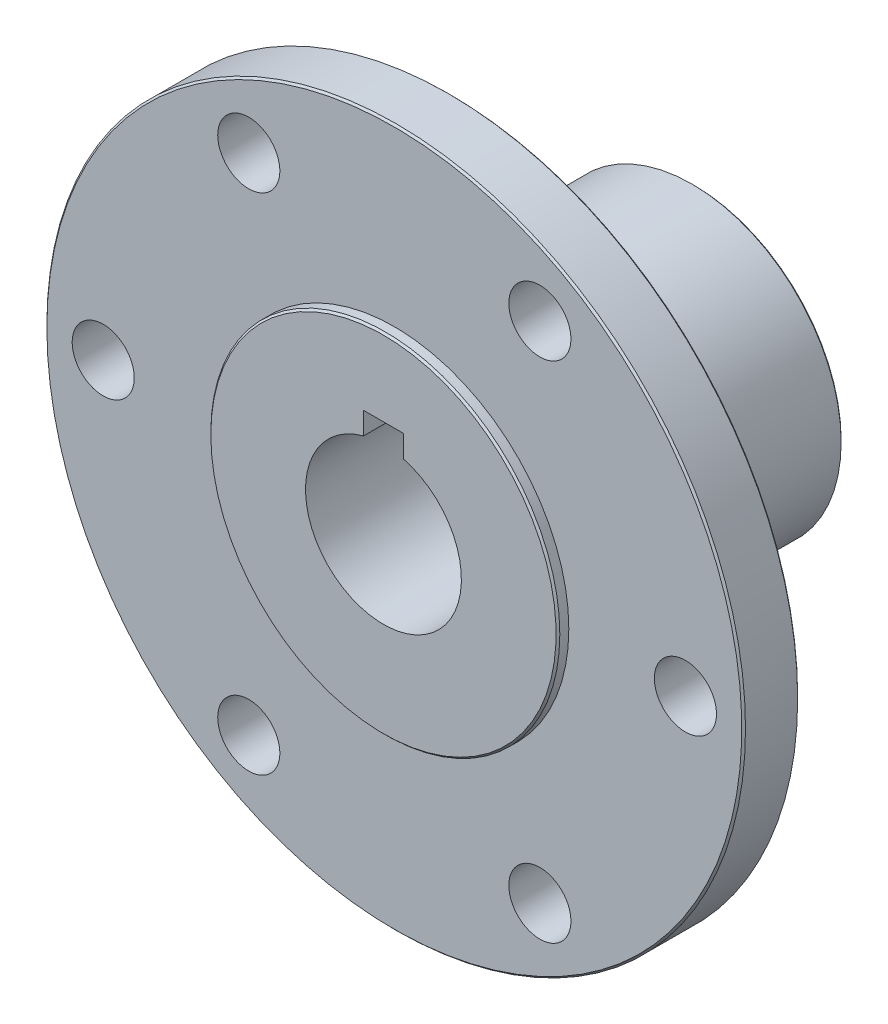
ISO-10303-21;
HEADER;
FILE_DESCRIPTION(('STEP AP214'),'2;1');
FILE_NAME('part.step','',(''),(''),'','','');
FILE_SCHEMA(('AUTOMOTIVE_DESIGN { 1 0 10303 214 1 1 1 1 }'));
ENDSEC;
DATA;
#1=APPLICATION_CONTEXT('core data for automotive mechanical design processes');
#2=APPLICATION_PROTOCOL_DEFINITION('international standard','automotive_design',2000,#1);
#3=PRODUCT_CONTEXT('',#1,'mechanical');
#4=PRODUCT('Part','Part','',(#3));
#5=PRODUCT_RELATED_PRODUCT_CATEGORY('part','',(#4));
#6=PRODUCT_DEFINITION_FORMATION('','',#4);
#7=PRODUCT_DEFINITION_CONTEXT('part definition',#1,'design');
#8=PRODUCT_DEFINITION('design','',#6,#7);
#9=PRODUCT_DEFINITION_SHAPE('','',#8);
#10=(LENGTH_UNIT() NAMED_UNIT(*) SI_UNIT(.MILLI.,.METRE.));
#11=(NAMED_UNIT(*) PLANE_ANGLE_UNIT() SI_UNIT($,.RADIAN.));
#12=(NAMED_UNIT(*) SI_UNIT($,.STERADIAN.) SOLID_ANGLE_UNIT());
#13=UNCERTAINTY_MEASURE_WITH_UNIT(LENGTH_MEASURE(1.E-05),#10,'distance_accuracy_value','');
#14=(GEOMETRIC_REPRESENTATION_CONTEXT(3) GLOBAL_UNCERTAINTY_ASSIGNED_CONTEXT((#13)) GLOBAL_UNIT_ASSIGNED_CONTEXT((#10,
#11,#12)) REPRESENTATION_CONTEXT('',''));
#15=CARTESIAN_POINT('',(0.,0.,0.));
#16=DIRECTION('',(0.,0.,1.));
#17=DIRECTION('',(1.,0.,0.));
#18=AXIS2_PLACEMENT_3D('',#15,#16,#17);
#19=CARTESIAN_POINT('',(0.,0.,-19.05));
#20=DIRECTION('',(0.,0.,1.));
#21=DIRECTION('',(1.,0.,0.));
#22=AXIS2_PLACEMENT_3D('',#19,#20,#21);
#23=CYLINDRICAL_SURFACE('',#22,12.192);
#24=CARTESIAN_POINT('',(0.,-12.192,-6.35));
#25=CARTESIAN_POINT('',(-0.175178769078229,-12.1919972222022,-6.35000445992635));
#26=CARTESIAN_POINT('',(-0.350406075703609,-12.1881871263774,-6.36454675198558));
#27=CARTESIAN_POINT('',(-0.69582271597809,-12.1733575982962,-6.42223479864495));
#28=CARTESIAN_POINT('',(-0.866009414013592,-12.1623344617222,-6.4653952504933));
#29=CARTESIAN_POINT('',(-1.19630816090729,-12.1342970377197,-6.57882867425515));
#30=CARTESIAN_POINT('',(-1.35643256848508,-12.1172902759936,-6.64906759970726));
#31=CARTESIAN_POINT('',(-1.66262756367885,-12.0790882117793,-6.81454036967587));
#32=CARTESIAN_POINT('',(-1.80869738842925,-12.0578926821203,-6.90977556991492));
#33=CARTESIAN_POINT('',(-2.08587969639434,-12.0130801685357,-7.12477018626725));
#34=CARTESIAN_POINT('',(-2.21663569350621,-11.9894233161875,-7.24498090776616));
#35=CARTESIAN_POINT('',(-2.45637791012349,-11.9426137863003,-7.50554890841107));
#36=CARTESIAN_POINT('',(-2.56536146238018,-11.9194611708422,-7.64590865231206));
#37=CARTESIAN_POINT('',(-2.76017972152825,-11.8758759937563,-7.94560625643621));
#38=CARTESIAN_POINT('',(-2.84560865341558,-11.855493854447,-8.1052158942289));
#39=CARTESIAN_POINT('',(-2.98828064189423,-11.820341753401,-8.43714862683517));
#40=CARTESIAN_POINT('',(-3.04552862936049,-11.8055708099658,-8.60946949146899));
#41=CARTESIAN_POINT('',(-3.12898396973005,-11.7837244369758,-8.9579956662678));
#42=CARTESIAN_POINT('',(-3.1558356271565,-11.7764895433296,-9.13403646158879));
#43=CARTESIAN_POINT('',(-3.17974412565684,-11.7700576598422,-9.48826130575506));
#44=CARTESIAN_POINT('',(-3.17680625627158,-11.7708592430136,-9.66644496849264));
#45=CARTESIAN_POINT('',(-3.1417315809834,-11.7802667818599,-10.0149036188275));
#46=CARTESIAN_POINT('',(-3.11036983081411,-11.7886655670421,-10.1852630974607));
#47=CARTESIAN_POINT('',(-3.02057709146969,-11.8119900572499,-10.5182150055736));
#48=CARTESIAN_POINT('',(-2.96214402837624,-11.8269162623325,-10.6808068389254));
#49=CARTESIAN_POINT('',(-2.81922481050141,-11.8617989909066,-10.995650457932));
#50=CARTESIAN_POINT('',(-2.73446329751622,-11.8818082528489,-11.1477711589043));
#51=CARTESIAN_POINT('',(-2.54148552382977,-11.9245736653226,-11.4359045532966));
#52=CARTESIAN_POINT('',(-2.43326484044204,-11.9473303334554,-11.5719142018612));
#53=CARTESIAN_POINT('',(-2.19245799922452,-11.9938926137752,-11.8283980558035));
#54=CARTESIAN_POINT('',(-2.05921975178593,-12.0177088584428,-11.9482589249626));
#55=CARTESIAN_POINT('',(-1.77424487472883,-12.0630719627827,-12.1640576353961));
#56=CARTESIAN_POINT('',(-1.62250758164116,-12.0846187410086,-12.259994618263));
#57=CARTESIAN_POINT('',(-1.30392064852997,-12.1231377422072,-12.4254750383825));
#58=CARTESIAN_POINT('',(-1.13701322593496,-12.1400914038242,-12.4949118334487));
#59=CARTESIAN_POINT('',(-0.793352902722708,-12.167379518368,-12.6045663767765));
#60=CARTESIAN_POINT('',(-0.616602058951869,-12.1777153485344,-12.6447902047945));
#61=CARTESIAN_POINT('',(-0.263510176518137,-12.1903966573512,-12.6939240637056));
#62=CARTESIAN_POINT('',(-0.0872927168625877,-12.1929549929709,-12.7036684857243));
#63=CARTESIAN_POINT('',(0.26425711890912,-12.1904028480231,-12.6938651771711));
#64=CARTESIAN_POINT('',(0.439589580267204,-12.1852931207434,-12.674320323891));
#65=CARTESIAN_POINT('',(0.781444332473162,-12.1681160682014,-12.6071790148851));
#66=CARTESIAN_POINT('',(0.948063544289819,-12.1561632779101,-12.5600440609912));
#67=CARTESIAN_POINT('',(1.27101681880787,-12.126652422739,-12.4395930997122));
#68=CARTESIAN_POINT('',(1.42734979229547,-12.1090937654003,-12.3662743249788));
#69=CARTESIAN_POINT('',(1.72856473093804,-12.0698158147332,-12.1939628893027));
#70=CARTESIAN_POINT('',(1.87317442579228,-12.0480241570007,-12.094511178757));
#71=CARTESIAN_POINT('',(2.14394674751112,-12.0028010574438,-11.8733376886977));
#72=CARTESIAN_POINT('',(2.27010589802543,-11.9793693078288,-11.7516117220924));
#73=CARTESIAN_POINT('',(2.50388259717037,-11.9327301664181,-11.4854583024661));
#74=CARTESIAN_POINT('',(2.61091266989061,-11.909545614015,-11.3405099110365));
#75=CARTESIAN_POINT('',(2.79913754857967,-11.8667201282515,-11.0342241586555));
#76=CARTESIAN_POINT('',(2.88033346670689,-11.8470790423609,-10.8728875036123));
#77=CARTESIAN_POINT('',(3.01397438194957,-11.8137871881037,-10.5392378596927));
#78=CARTESIAN_POINT('',(3.06658807255543,-11.8001013690893,-10.3669961238854));
#79=CARTESIAN_POINT('',(3.14198917782765,-11.7802511412504,-10.0156960889298));
#80=CARTESIAN_POINT('',(3.16478378791037,-11.7740849179536,-9.83663944497126));
#81=CARTESIAN_POINT('',(3.17950004547031,-11.7701185981767,-9.48279272452331));
#82=CARTESIAN_POINT('',(3.17236384809854,-11.7720631807374,-9.30804409210789));
#83=CARTESIAN_POINT('',(3.12959538170951,-11.783504438539,-8.96233429077626));
#84=CARTESIAN_POINT('',(3.09396378269,-11.7930009362158,-8.79137303290658));
#85=CARTESIAN_POINT('',(2.99575033519074,-11.818327668863,-8.45921503225583));
#86=CARTESIAN_POINT('',(2.93335937690623,-11.8341129863162,-8.29795818277496));
#87=CARTESIAN_POINT('',(2.78354734008,-11.8702417530349,-7.98808132680459));
#88=CARTESIAN_POINT('',(2.69612250463512,-11.8905858863549,-7.83946322139149));
#89=CARTESIAN_POINT('',(2.49583153114034,-11.9342556818932,-7.55456404632131));
#90=CARTESIAN_POINT('',(2.38231830892747,-11.9576491699038,-7.41874822317543));
#91=CARTESIAN_POINT('',(2.13431504479822,-12.0043932959216,-7.16778640214905));
#92=CARTESIAN_POINT('',(1.99981995839061,-12.0277439222544,-7.05264538929406));
#93=CARTESIAN_POINT('',(1.71040597613153,-12.0723325696543,-6.84403179664104));
#94=CARTESIAN_POINT('',(1.55513068393735,-12.093518649746,-6.75104164726823));
#95=CARTESIAN_POINT('',(1.23060806509617,-12.1308309959165,-6.59263206744137));
#96=CARTESIAN_POINT('',(1.06137019914677,-12.1469606531093,-6.52719414880437));
#97=CARTESIAN_POINT('',(0.743860160391215,-12.1701420697107,-6.43473476550779));
#98=CARTESIAN_POINT('',(0.597013452551387,-12.1782803860783,-6.40303104462439));
#99=CARTESIAN_POINT('',(0.300122847168798,-12.1892103025645,-6.36066269012588));
#100=CARTESIAN_POINT('',(0.150079236134964,-12.1920023797962,-6.34999617908983));
#101=CARTESIAN_POINT('',(0.,-12.192,-6.35));
#102=B_SPLINE_CURVE_WITH_KNOTS('',3,(#24,#25,#26,#27,#28,#29,#30,#31,#32,#33,#34,#35,#36,#37,
#38,#39,#40,#41,#42,#43,#44,#45,#46,#47,#48,#49,#50,#51,#52,#53,#54,#55,#56,#57,#58,#59,#60,#61,
#62,#63,#64,#65,#66,#67,#68,#69,#70,#71,#72,#73,#74,#75,#76,#77,#78,#79,#80,#81,#82,#83,#84,#85,
#86,#87,#88,#89,#90,#91,#92,#93,#94,#95,#96,#97,#98,#99,#100,#101),.UNSPECIFIED.,.T.,.F.,(4,2,2,
2,2,2,2,2,2,2,2,2,2,2,2,2,2,2,2,2,2,2,2,2,2,2,2,2,2,2,2,2,2,2,2,2,2,2,4),(0.,0.524986079765197,
1.05024198236789,1.5748396098191,2.0994656957448,2.63455683489542,3.16971348562067,
3.71358302734362,4.25735737329486,4.7893759820574,5.32130012524169,5.83914239830304,
6.35702434953643,6.8805161484106,7.40410672557756,7.94395115407615,8.48381494982038,
9.02582891814377,9.5677300510266,10.0946603470404,10.621538882372,11.1398464173776,
11.6582087481364,12.1863682028415,12.7146270426001,13.2570421426754,13.7994338886615,
14.3385886416688,14.8776132713153,15.3998000543289,15.9219745597935,16.4404844749107,
16.9590722450633,17.4922630352716,18.0255822141286,18.5696287497086,19.1133096334333,
19.5631160945414,20.012882411814),.UNSPECIFIED.);
#103=CARTESIAN_POINT('',(0.,-12.192,-6.35));
#104=VERTEX_POINT('',#103);
#105=EDGE_CURVE('E118',#104,#104,#102,.T.);
#106=ORIENTED_EDGE('',*,*,#105,.F.);
#107=EDGE_LOOP('',(#106));
#108=FACE_BOUND('',#107,.T.);
#109=CARTESIAN_POINT('',(0.,0.,-0.50800000000005));
#110=DIRECTION('',(0.,0.,1.));
#111=DIRECTION('',(1.,0.,0.));
#112=AXIS2_PLACEMENT_3D('',#109,#110,#111);
#113=CIRCLE('',#112,12.192);
#114=CARTESIAN_POINT('',(12.192,0.,-0.50800000000005));
#115=VERTEX_POINT('',#114);
#116=EDGE_CURVE('E112',#115,#115,#113,.T.);
#117=ORIENTED_EDGE('',*,*,#116,.F.);
#118=EDGE_LOOP('',(#117));
#119=FACE_BOUND('',#118,.T.);
#120=CARTESIAN_POINT('',(0.,0.,-18.8976000000001));
#121=DIRECTION('',(0.,0.,1.));
#122=DIRECTION('',(1.,0.,0.));
#123=AXIS2_PLACEMENT_3D('',#120,#121,#122);
#124=CIRCLE('',#123,12.192);
#125=CARTESIAN_POINT('',(12.192,0.,-18.8976000000001));
#126=VERTEX_POINT('',#125);
#127=EDGE_CURVE('E116',#126,#126,#124,.F.);
#128=ORIENTED_EDGE('',*,*,#127,.F.);
#129=EDGE_LOOP('',(#128));
#130=FACE_BOUND('',#129,.T.);
#131=ADVANCED_FACE('F34',(#108,#119,#130),#23,.T.);
#132=CARTESIAN_POINT('',(0.,0.,-18.8976000000001));
#133=DIRECTION('',(0.,0.,1.));
#134=DIRECTION('',(1.,0.,0.));
#135=AXIS2_PLACEMENT_3D('',#132,#133,#134);
#136=CONICAL_SURFACE('',#135,12.192,0.785398163397448);
#137=ORIENTED_EDGE('',*,*,#127,.T.);
#138=EDGE_LOOP('',(#137));
#139=FACE_BOUND('',#138,.T.);
#140=CARTESIAN_POINT('',(0.,0.,-19.05));
#141=DIRECTION('',(0.,0.,1.));
#142=DIRECTION('',(1.,0.,0.));
#143=AXIS2_PLACEMENT_3D('',#140,#141,#142);
#144=CIRCLE('',#143,12.0396000000001);
#145=CARTESIAN_POINT('',(12.0396000000001,0.,-19.05));
#146=VERTEX_POINT('',#145);
#147=EDGE_CURVE('E115',#146,#146,#144,.F.);
#148=ORIENTED_EDGE('',*,*,#147,.F.);
#149=EDGE_LOOP('',(#148));
#150=FACE_BOUND('',#149,.T.);
#151=ADVANCED_FACE('F179',(#139,#150),#136,.T.);
#152=CARTESIAN_POINT('',(0.,0.,0.));
#153=DIRECTION('',(0.,0.,1.));
#154=DIRECTION('',(1.,0.,0.));
#155=AXIS2_PLACEMENT_3D('',#152,#153,#154);
#156=CONICAL_SURFACE('',#155,12.7,0.785398163397448);
#157=CARTESIAN_POINT('',(0.,0.,0.));
#158=DIRECTION('',(0.,0.,1.));
#159=DIRECTION('',(1.,0.,0.));
#160=AXIS2_PLACEMENT_3D('',#157,#158,#159);
#161=CIRCLE('',#160,12.7);
#162=CARTESIAN_POINT('',(12.7,0.,0.));
#163=VERTEX_POINT('',#162);
#164=EDGE_CURVE('E98',#163,#163,#161,.F.);
#165=ORIENTED_EDGE('',*,*,#164,.T.);
#166=EDGE_LOOP('',(#165));
#167=FACE_BOUND('',#166,.T.);
#168=ORIENTED_EDGE('',*,*,#116,.T.);
#169=EDGE_LOOP('',(#168));
#170=FACE_BOUND('',#169,.T.);
#171=ADVANCED_FACE('F181',(#167,#170),#156,.T.);
#172=CARTESIAN_POINT('',(0.,0.,-19.05));
#173=DIRECTION('',(0.,0.,-1.));
#174=DIRECTION('',(-1.,0.,0.));
#175=AXIS2_PLACEMENT_3D('',#172,#173,#174);
#176=PLANE('',#175);
#177=DIRECTION('',(1.,0.,0.));
#178=VECTOR('',#177,1.);
#179=CARTESIAN_POINT('',(-1.6256,7.9756,-19.05));
#180=LINE('',#179,#178);
#181=CARTESIAN_POINT('',(-1.6256,7.9756,-19.05));
#182=VERTEX_POINT('',#181);
#183=CARTESIAN_POINT('',(1.6256,7.9756,-19.05));
#184=VERTEX_POINT('',#183);
#185=EDGE_CURVE('E108',#182,#184,#180,.T.);
#186=ORIENTED_EDGE('',*,*,#185,.F.);
#187=DIRECTION('',(0.,1.,0.));
#188=VECTOR('',#187,1.);
#189=CARTESIAN_POINT('',(-1.6256,6.16466948019113,-19.05));
#190=LINE('',#189,#188);
#191=CARTESIAN_POINT('',(-1.6256,6.16466948019113,-19.05));
#192=VERTEX_POINT('',#191);
#193=EDGE_CURVE('E85',#192,#182,#190,.T.);
#194=ORIENTED_EDGE('',*,*,#193,.F.);
#195=CARTESIAN_POINT('',(0.,0.,-19.05));
#196=DIRECTION('',(0.,0.,-1.));
#197=DIRECTION('',(-1.,0.,0.));
#198=AXIS2_PLACEMENT_3D('',#195,#196,#197);
#199=CIRCLE('',#198,6.3754);
#200=CARTESIAN_POINT('',(1.6256,6.16466948019113,-19.05));
#201=VERTEX_POINT('',#200);
#202=EDGE_CURVE('E76',#192,#201,#199,.F.);
#203=ORIENTED_EDGE('',*,*,#202,.T.);
#204=DIRECTION('',(0.,-1.,0.));
#205=VECTOR('',#204,1.);
#206=CARTESIAN_POINT('',(1.6256,7.9756,-19.05));
#207=LINE('',#206,#205);
#208=EDGE_CURVE('E83',#184,#201,#207,.T.);
#209=ORIENTED_EDGE('',*,*,#208,.F.);
#210=EDGE_LOOP('',(#186,#194,#203,#209));
#211=FACE_BOUND('',#210,.T.);
#212=ORIENTED_EDGE('',*,*,#147,.T.);
#213=EDGE_LOOP('',(#212));
#214=FACE_BOUND('',#213,.T.);
#215=ADVANCED_FACE('F81',(#211,#214),#176,.T.);
#216=CARTESIAN_POINT('',(0.,0.,0.));
#217=DIRECTION('',(0.,0.,1.));
#218=DIRECTION('',(1.,0.,0.));
#219=AXIS2_PLACEMENT_3D('',#216,#217,#218);
#220=PLANE('',#219);
#221=ORIENTED_EDGE('',*,*,#164,.F.);
#222=EDGE_LOOP('',(#221));
#223=FACE_BOUND('',#222,.T.);
#224=CARTESIAN_POINT('',(0.,0.,0.));
#225=DIRECTION('',(0.,0.,1.));
#226=DIRECTION('',(1.,0.,0.));
#227=AXIS2_PLACEMENT_3D('',#224,#225,#226);
#228=CIRCLE('',#227,14.1224);
#229=CARTESIAN_POINT('',(14.1224,0.,0.));
#230=VERTEX_POINT('',#229);
#231=EDGE_CURVE('E107',#230,#230,#228,.T.);
#232=ORIENTED_EDGE('',*,*,#231,.F.);
#233=EDGE_LOOP('',(#232));
#234=FACE_BOUND('',#233,.T.);
#235=ADVANCED_FACE('F274',(#223,#234),#220,.F.);
#236=CARTESIAN_POINT('',(1.6256,7.9756,6.35));
#237=DIRECTION('',(-1.,0.,0.));
#238=DIRECTION('',(0.,-1.,0.));
#239=AXIS2_PLACEMENT_3D('',#236,#237,#238);
#240=PLANE('',#239);
#241=DIRECTION('',(0.,0.,-1.));
#242=VECTOR('',#241,1.);
#243=CARTESIAN_POINT('',(1.6256,6.16466948019113,6.35));
#244=LINE('',#243,#242);
#245=CARTESIAN_POINT('',(1.6256,6.16466948019113,6.35));
#246=VERTEX_POINT('',#245);
#247=EDGE_CURVE('E88',#201,#246,#244,.F.);
#248=ORIENTED_EDGE('',*,*,#247,.T.);
#249=DIRECTION('',(0.,1.,0.));
#250=VECTOR('',#249,1.);
#251=CARTESIAN_POINT('',(1.6256,0.,6.35));
#252=LINE('',#251,#250);
#253=CARTESIAN_POINT('',(1.6256,7.9756,6.35));
#254=VERTEX_POINT('',#253);
#255=EDGE_CURVE('E172',#254,#246,#252,.F.);
#256=ORIENTED_EDGE('',*,*,#255,.F.);
#257=DIRECTION('',(0.,0.,-1.));
#258=VECTOR('',#257,1.);
#259=CARTESIAN_POINT('',(1.6256,7.9756,6.35));
#260=LINE('',#259,#258);
#261=EDGE_CURVE('E96',#184,#254,#260,.F.);
#262=ORIENTED_EDGE('',*,*,#261,.F.);
#263=ORIENTED_EDGE('',*,*,#208,.T.);
#264=EDGE_LOOP('',(#248,#256,#262,#263));
#265=FACE_BOUND('',#264,.T.);
#266=ADVANCED_FACE('F92',(#265),#240,.T.);
#267=CARTESIAN_POINT('',(0.,0.,6.35));
#268=DIRECTION('',(0.,0.,-1.));
#269=DIRECTION('',(-1.,0.,0.));
#270=AXIS2_PLACEMENT_3D('',#267,#268,#269);
#271=CYLINDRICAL_SURFACE('',#270,6.3754);
#272=CARTESIAN_POINT('',(0.,-6.3754,-6.35));
#273=CARTESIAN_POINT('',(-0.0835368776073097,-6.37539929383747,-6.35000090922668));
#274=CARTESIAN_POINT('',(-0.16708318640892,-6.37375257479154,-6.3533030548642));
#275=CARTESIAN_POINT('',(-0.333540211647836,-6.36721586851187,-6.36646186048729));
#276=CARTESIAN_POINT('',(-0.416450632005033,-6.36232445343936,-6.37632140608249));
#277=CARTESIAN_POINT('',(-0.663510251507003,-6.34292248544274,-6.41563738551784));
#278=CARTESIAN_POINT('',(-0.825863322817389,-6.32368446087722,-6.45483096111474));
#279=CARTESIAN_POINT('',(-1.14023291616476,-6.27462359432825,-6.55720866731804));
#280=CARTESIAN_POINT('',(-1.29228684272543,-6.24484180710564,-6.62029981246909));
#281=CARTESIAN_POINT('',(-1.58346160058584,-6.17743542102096,-6.76820119075903));
#282=CARTESIAN_POINT('',(-1.72258351749144,-6.13981148134685,-6.85300959854639));
#283=CARTESIAN_POINT('',(-1.99332012101148,-6.05752554144436,-7.04775206432184));
#284=CARTESIAN_POINT('',(-2.12397974515892,-6.01257630993762,-7.1588906876699));
#285=CARTESIAN_POINT('',(-2.36567590597183,-5.92165566453594,-7.40050888360717));
#286=CARTESIAN_POINT('',(-2.47669761702858,-5.875683507612,-7.53100293305702));
#287=CARTESIAN_POINT('',(-2.68456194420209,-5.78383503766544,-7.8197996791969));
#288=CARTESIAN_POINT('',(-2.77966153444195,-5.73823706581851,-7.97946820540509));
#289=CARTESIAN_POINT('',(-2.900808749693,-5.6774184359294,-8.23092801905502));
#290=CARTESIAN_POINT('',(-2.93761627085097,-5.65840346413269,-8.31677186456076));
#291=CARTESIAN_POINT('',(-3.00368684641891,-5.62360956153632,-8.49193000998356));
#292=CARTESIAN_POINT('',(-3.03295434198496,-5.60782872692055,-8.58124223114871));
#293=CARTESIAN_POINT('',(-3.0820651298405,-5.58097997659262,-8.75730591256124));
#294=CARTESIAN_POINT('',(-3.10236325379112,-5.56968860527305,-8.84389664644137));
#295=CARTESIAN_POINT('',(-3.13565878082169,-5.55101199049653,-9.0188455469106));
#296=CARTESIAN_POINT('',(-3.14866004261493,-5.54362468262078,-9.10720275370564));
#297=CARTESIAN_POINT('',(-3.16716749637057,-5.53307261996395,-9.28490477316265));
#298=CARTESIAN_POINT('',(-3.172678118204,-5.52990536951551,-9.37424897058343));
#299=CARTESIAN_POINT('',(-3.17613730716373,-5.52791735208129,-9.55310237621507));
#300=CARTESIAN_POINT('',(-3.17408658560179,-5.52909617625096,-9.64261156811279));
#301=CARTESIAN_POINT('',(-3.15798650670227,-5.53832621098326,-9.88897350245089));
#302=CARTESIAN_POINT('',(-3.13599203475239,-5.55092563752422,-10.0452243046641));
#303=CARTESIAN_POINT('',(-3.06959349729551,-5.58790773098731,-10.3513299080982));
#304=CARTESIAN_POINT('',(-3.02518238789419,-5.61229410157359,-10.5011826828286));
#305=CARTESIAN_POINT('',(-2.91441184534585,-5.67061873702822,-10.7946430661971));
#306=CARTESIAN_POINT('',(-2.84756500744797,-5.70476637235947,-10.9380237295946));
#307=CARTESIAN_POINT('',(-2.69418943646779,-5.77878091557171,-11.2122113764515));
#308=CARTESIAN_POINT('',(-2.60765186797594,-5.8186503879182,-11.3430126778391));
#309=CARTESIAN_POINT('',(-2.40467034388691,-5.90567014062801,-11.6056420419094));
#310=CARTESIAN_POINT('',(-2.28583485157173,-5.95310578240089,-11.7355338505467));
#311=CARTESIAN_POINT('',(-2.02786541979753,-6.0458479480783,-11.9743470470886));
#312=CARTESIAN_POINT('',(-1.88872198057058,-6.09115346235347,-12.0832585650931));
#313=CARTESIAN_POINT('',(-1.58601993846611,-6.17706218727635,-12.2816949999025));
#314=CARTESIAN_POINT('',(-1.42163582169702,-6.2173556249193,-12.3701056337041));
#315=CARTESIAN_POINT('',(-1.07781221184184,-6.28607031841328,-12.5172961543668));
#316=CARTESIAN_POINT('',(-0.898384714419335,-6.3145009276197,-12.5760993930395));
#317=CARTESIAN_POINT('',(-0.54541815799726,-6.35430184375412,-12.657602896736));
#318=CARTESIAN_POINT('',(-0.372611739465657,-6.36688466209404,-12.6828783163284));
#319=CARTESIAN_POINT('',(-0.0247774684821219,-6.37772135404569,-12.7046749854025));
#320=CARTESIAN_POINT('',(0.150249305735361,-6.37598193538096,-12.7012096953969));
#321=CARTESIAN_POINT('',(0.483274232951295,-6.35907658823765,-12.667122386515));
#322=CARTESIAN_POINT('',(0.641548281655185,-6.34495145292224,-12.6386051852221));
#323=CARTESIAN_POINT('',(0.950749463921727,-6.30603619760184,-12.5585151073742));
#324=CARTESIAN_POINT('',(1.10167578257037,-6.28124489763142,-12.5069396799328));
#325=CARTESIAN_POINT('',(1.3969195924236,-6.22235223013762,-12.3808289581514));
#326=CARTESIAN_POINT('',(1.54092219558775,-6.1880036205147,-12.3056760224277));
#327=CARTESIAN_POINT('',(1.81475132518528,-6.1133115892483,-12.135238115761));
#328=CARTESIAN_POINT('',(1.94457175594132,-6.07296560730909,-12.0399445393546));
#329=CARTESIAN_POINT('',(2.19978502175197,-5.98553198600857,-11.821193709506));
#330=CARTESIAN_POINT('',(2.32350903725283,-5.93817068885016,-11.6958954095221));
#331=CARTESIAN_POINT('',(2.54892054498733,-5.84496686637732,-11.4261961898579));
#332=CARTESIAN_POINT('',(2.6505930928529,-5.79912538876402,-11.2817824216205));
#333=CARTESIAN_POINT('',(2.83353824287761,-5.71205300199291,-10.9692910768586));
#334=CARTESIAN_POINT('',(2.91361585629789,-5.67114350857034,-10.8004164325697));
#335=CARTESIAN_POINT('',(3.04335755731112,-5.60260334732886,-10.4488943680559));
#336=CARTESIAN_POINT('',(3.09306052741771,-5.57495571283215,-10.2662648933578));
#337=CARTESIAN_POINT('',(3.15608447041091,-5.53949876062157,-9.91112805810408));
#338=CARTESIAN_POINT('',(3.17243310372236,-5.53004352701554,-9.73932564537267));
#339=CARTESIAN_POINT('',(3.17700360093508,-5.52742246468417,-9.39525309033745));
#340=CARTESIAN_POINT('',(3.16523733713039,-5.53424976020759,-9.22298317613522));
#341=CARTESIAN_POINT('',(3.11673685817991,-5.56168288002341,-8.89989883984284));
#342=CARTESIAN_POINT('',(3.08244861682307,-5.58093595652299,-8.74858778108806));
#343=CARTESIAN_POINT('',(2.99288373174464,-5.62947159565942,-8.45402572365281));
#344=CARTESIAN_POINT('',(2.93760037798883,-5.6587573644496,-8.31077731861851));
#345=CARTESIAN_POINT('',(2.80345296425472,-5.72646235581641,-8.02575381703923));
#346=CARTESIAN_POINT('',(2.72325358619794,-5.76536320778977,-7.88472505704834));
#347=CARTESIAN_POINT('',(2.54302626231892,-5.84709549771171,-7.61720552755574));
#348=CARTESIAN_POINT('',(2.44298804653036,-5.88992896526287,-7.49072234166199));
#349=CARTESIAN_POINT('',(2.21185002743117,-5.98085787958765,-7.24009279960654));
#350=CARTESIAN_POINT('',(2.07846209023319,-6.02896703756911,-7.11805423800667));
#351=CARTESIAN_POINT('',(1.79164431985645,-6.12032005809961,-6.8975861888054));
#352=CARTESIAN_POINT('',(1.63820385191954,-6.16356131617009,-6.79916930796459));
#353=CARTESIAN_POINT('',(1.39533114923247,-6.22139990893039,-6.67155516884764));
#354=CARTESIAN_POINT('',(1.31192156106772,-6.23956304546268,-6.63224416841703));
#355=CARTESIAN_POINT('',(1.14151227284188,-6.27297319152325,-6.56086566390091));
#356=CARTESIAN_POINT('',(1.0545143609133,-6.28822163265765,-6.52879460237813));
#357=CARTESIAN_POINT('',(0.877763732110274,-6.31531763333039,-6.47233761954436));
#358=CARTESIAN_POINT('',(0.788017529193142,-6.32717263533163,-6.44793486847263));
#359=CARTESIAN_POINT('',(0.606374607119032,-6.34715461393685,-6.40705338179261));
#360=CARTESIAN_POINT('',(0.514479244940487,-6.35528387955911,-6.39056978051511));
#361=CARTESIAN_POINT('',(0.352112461283871,-6.36605392141932,-6.36879881035764));
#362=CARTESIAN_POINT('',(0.281927498192014,-6.36955264004884,-6.36175526069715));
#363=CARTESIAN_POINT('',(0.141163941752379,-6.37422600969419,-6.3523554068186));
#364=CARTESIAN_POINT('',(0.0705853376133483,-6.37540059667924,-6.34999923173963));
#365=CARTESIAN_POINT('',(0.,-6.3754,-6.35));
#366=B_SPLINE_CURVE_WITH_KNOTS('',3,(#272,#273,#274,#275,#276,#277,#278,#279,#280,#281,#282,
#283,#284,#285,#286,#287,#288,#289,#290,#291,#292,#293,#294,#295,#296,#297,#298,#299,#300,#301,
#302,#303,#304,#305,#306,#307,#308,#309,#310,#311,#312,#313,#314,#315,#316,#317,#318,#319,#320,
#321,#322,#323,#324,#325,#326,#327,#328,#329,#330,#331,#332,#333,#334,#335,#336,#337,#338,#339,
#340,#341,#342,#343,#344,#345,#346,#347,#348,#349,#350,#351,#352,#353,#354,#355,#356,#357,#358,
#359,#360,#361,#362,#363,#364,#365),.UNSPECIFIED.,.T.,.F.,(4,2,2,2,2,2,2,2,2,2,2,2,2,2,2,2,2,2,
2,2,2,2,2,2,2,2,2,2,2,2,2,2,2,2,2,2,2,2,2,2,2,2,2,2,2,2,4),(0.,0.250536559069447,
0.501183440748227,1.0028455707279,1.50257545746482,2.00226335532431,2.53201070245178,
3.06215629017569,3.63300413509566,3.91862139650174,4.20407003964413,4.47264450190877,
4.7410768029723,5.00935028735499,5.27759853532045,5.75003714726311,6.2226243042885,
6.70622557483243,7.19004427107568,7.73465760929769,8.27952653130316,8.84931183346274,
9.41864703037752,9.94107915042274,10.4632666068142,10.9453737971116,11.427534335184,
11.9235612215862,12.4198004747063,12.964473478195,13.5095144632787,14.0803830874413,
14.6505194048004,15.166070175652,15.6814032793874,16.1483895062115,16.6155251075241,
17.1140622122345,17.6128580713923,18.171601171877,18.7306418106863,19.0122594233535,
19.2937383569181,19.5745951384866,19.8552791351612,20.0669667266292,20.2786601500959),.UNSPECIFIED.);
#367=CARTESIAN_POINT('',(0.,-6.3754,-6.35));
#368=VERTEX_POINT('',#367);
#369=EDGE_CURVE('E38',#368,#368,#366,.T.);
#370=ORIENTED_EDGE('',*,*,#369,.T.);
#371=EDGE_LOOP('',(#370));
#372=FACE_BOUND('',#371,.T.);
#373=CARTESIAN_POINT('',(0.,0.,6.35));
#374=DIRECTION('',(0.,0.,-1.));
#375=DIRECTION('',(-1.,0.,0.));
#376=AXIS2_PLACEMENT_3D('',#373,#374,#375);
#377=CIRCLE('',#376,6.3754);
#378=CARTESIAN_POINT('',(-1.6256,6.16466948019113,6.35));
#379=VERTEX_POINT('',#378);
#380=EDGE_CURVE('E102',#246,#379,#377,.T.);
#381=ORIENTED_EDGE('',*,*,#380,.F.);
#382=ORIENTED_EDGE('',*,*,#247,.F.);
#383=ORIENTED_EDGE('',*,*,#202,.F.);
#384=DIRECTION('',(0.,0.,1.));
#385=VECTOR('',#384,1.);
#386=CARTESIAN_POINT('',(-1.6256,6.16466948019113,6.35));
#387=LINE('',#386,#385);
#388=EDGE_CURVE('E87',#379,#192,#387,.F.);
#389=ORIENTED_EDGE('',*,*,#388,.F.);
#390=EDGE_LOOP('',(#381,#382,#383,#389));
#391=FACE_BOUND('',#390,.T.);
#392=ADVANCED_FACE('F100',(#372,#391),#271,.F.);
#393=CARTESIAN_POINT('',(-1.6256,6.16466948019113,6.35));
#394=DIRECTION('',(1.,0.,0.));
#395=DIRECTION('',(0.,1.,0.));
#396=AXIS2_PLACEMENT_3D('',#393,#394,#395);
#397=PLANE('',#396);
#398=DIRECTION('',(0.,0.,-1.));
#399=VECTOR('',#398,1.);
#400=CARTESIAN_POINT('',(-1.6256,7.9756,6.35));
#401=LINE('',#400,#399);
#402=CARTESIAN_POINT('',(-1.6256,7.9756,6.35));
#403=VERTEX_POINT('',#402);
#404=EDGE_CURVE('E57',#403,#182,#401,.T.);
#405=ORIENTED_EDGE('',*,*,#404,.F.);
#406=DIRECTION('',(0.,1.,0.));
#407=VECTOR('',#406,1.);
#408=CARTESIAN_POINT('',(-1.6256,0.,6.35));
#409=LINE('',#408,#407);
#410=EDGE_CURVE('E171',#379,#403,#409,.T.);
#411=ORIENTED_EDGE('',*,*,#410,.F.);
#412=ORIENTED_EDGE('',*,*,#388,.T.);
#413=ORIENTED_EDGE('',*,*,#193,.T.);
#414=EDGE_LOOP('',(#405,#411,#412,#413));
#415=FACE_BOUND('',#414,.T.);
#416=ADVANCED_FACE('F265',(#415),#397,.T.);
#417=CARTESIAN_POINT('',(-1.6256,7.9756,6.35));
#418=DIRECTION('',(0.,-1.,0.));
#419=DIRECTION('',(0.,0.,-1.));
#420=AXIS2_PLACEMENT_3D('',#417,#418,#419);
#421=PLANE('',#420);
#422=ORIENTED_EDGE('',*,*,#261,.T.);
#423=DIRECTION('',(1.,0.,0.));
#424=VECTOR('',#423,1.);
#425=CARTESIAN_POINT('',(0.,7.9756,6.35));
#426=LINE('',#425,#424);
#427=EDGE_CURVE('E440',#403,#254,#426,.T.);
#428=ORIENTED_EDGE('',*,*,#427,.F.);
#429=ORIENTED_EDGE('',*,*,#404,.T.);
#430=ORIENTED_EDGE('',*,*,#185,.T.);
#431=EDGE_LOOP('',(#422,#428,#429,#430));
#432=FACE_BOUND('',#431,.T.);
#433=ADVANCED_FACE('F261',(#432),#421,.T.);
#434=CARTESIAN_POINT('',(0.,0.,0.152399999999999));
#435=DIRECTION('',(0.,0.,1.));
#436=DIRECTION('',(1.,0.,0.));
#437=AXIS2_PLACEMENT_3D('',#434,#435,#436);
#438=CONICAL_SURFACE('',#437,14.2748,0.785398163397461);
#439=ORIENTED_EDGE('',*,*,#231,.T.);
#440=EDGE_LOOP('',(#439));
#441=FACE_BOUND('',#440,.T.);
#442=CARTESIAN_POINT('',(0.,0.,0.152399999999999));
#443=DIRECTION('',(0.,0.,1.));
#444=DIRECTION('',(1.,0.,0.));
#445=AXIS2_PLACEMENT_3D('',#442,#443,#444);
#446=CIRCLE('',#445,14.2748);
#447=CARTESIAN_POINT('',(14.2748,0.,0.152399999999999));
#448=VERTEX_POINT('',#447);
#449=EDGE_CURVE('E439',#448,#448,#446,.T.);
#450=ORIENTED_EDGE('',*,*,#449,.F.);
#451=EDGE_LOOP('',(#450));
#452=FACE_BOUND('',#451,.T.);
#453=ADVANCED_FACE('F257',(#441,#452),#438,.T.);
#454=CARTESIAN_POINT('',(0.,0.,6.35));
#455=DIRECTION('',(0.,0.,1.));
#456=DIRECTION('',(1.,0.,0.));
#457=AXIS2_PLACEMENT_3D('',#454,#455,#456);
#458=PLANE('',#457);
#459=ORIENTED_EDGE('',*,*,#410,.T.);
#460=ORIENTED_EDGE('',*,*,#427,.T.);
#461=ORIENTED_EDGE('',*,*,#255,.T.);
#462=ORIENTED_EDGE('',*,*,#380,.T.);
#463=EDGE_LOOP('',(#459,#460,#461,#462));
#464=FACE_BOUND('',#463,.T.);
#465=CARTESIAN_POINT('',(0.,0.,6.35));
#466=DIRECTION('',(0.,0.,-1.));
#467=DIRECTION('',(-1.,0.,0.));
#468=AXIS2_PLACEMENT_3D('',#465,#466,#467);
#469=CIRCLE('',#468,14.1224);
#470=CARTESIAN_POINT('',(-14.1224,0.,6.35));
#471=VERTEX_POINT('',#470);
#472=EDGE_CURVE('E166',#471,#471,#469,.T.);
#473=ORIENTED_EDGE('',*,*,#472,.F.);
#474=EDGE_LOOP('',(#473));
#475=FACE_BOUND('',#474,.T.);
#476=ADVANCED_FACE('F253',(#464,#475),#458,.T.);
#477=CARTESIAN_POINT('',(0.,0.,1.04140000000001));
#478=DIRECTION('',(0.,0.,1.));
#479=DIRECTION('',(1.,0.,0.));
#480=AXIS2_PLACEMENT_3D('',#477,#478,#479);
#481=CONICAL_SURFACE('',#480,28.575,0.785398163397446);
#482=CARTESIAN_POINT('',(0.,0.,1.04140000000001));
#483=DIRECTION('',(0.,0.,-1.));
#484=DIRECTION('',(-1.,0.,0.));
#485=AXIS2_PLACEMENT_3D('',#482,#483,#484);
#486=CIRCLE('',#485,28.575);
#487=CARTESIAN_POINT('',(-28.575,0.,1.04140000000001));
#488=VERTEX_POINT('',#487);
#489=EDGE_CURVE('E169',#488,#488,#486,.F.);
#490=ORIENTED_EDGE('',*,*,#489,.F.);
#491=EDGE_LOOP('',(#490));
#492=FACE_BOUND('',#491,.T.);
#493=CARTESIAN_POINT('',(0.,0.,0.889000000000001));
#494=DIRECTION('',(0.,0.,1.));
#495=DIRECTION('',(1.,0.,0.));
#496=AXIS2_PLACEMENT_3D('',#493,#494,#495);
#497=CIRCLE('',#496,28.4226);
#498=CARTESIAN_POINT('',(28.4226,0.,0.889000000000001));
#499=VERTEX_POINT('',#498);
#500=EDGE_CURVE('E163',#499,#499,#497,.F.);
#501=ORIENTED_EDGE('',*,*,#500,.F.);
#502=EDGE_LOOP('',(#501));
#503=FACE_BOUND('',#502,.T.);
#504=ADVANCED_FACE('F249',(#492,#503),#481,.T.);
#505=CARTESIAN_POINT('',(0.,0.,0.));
#506=DIRECTION('',(0.,0.,1.));
#507=DIRECTION('',(1.,0.,0.));
#508=AXIS2_PLACEMENT_3D('',#505,#506,#507);
#509=CYLINDRICAL_SURFACE('',#508,14.2748);
#510=ORIENTED_EDGE('',*,*,#449,.T.);
#511=EDGE_LOOP('',(#510));
#512=FACE_BOUND('',#511,.T.);
#513=CARTESIAN_POINT('',(0.,0.,0.889));
#514=DIRECTION('',(0.,0.,1.));
#515=DIRECTION('',(1.,0.,0.));
#516=AXIS2_PLACEMENT_3D('',#513,#514,#515);
#517=CIRCLE('',#516,14.2748);
#518=CARTESIAN_POINT('',(14.2748,0.,0.889));
#519=VERTEX_POINT('',#518);
#520=EDGE_CURVE('E159',#519,#519,#517,.T.);
#521=ORIENTED_EDGE('',*,*,#520,.F.);
#522=EDGE_LOOP('',(#521));
#523=FACE_BOUND('',#522,.T.);
#524=ADVANCED_FACE('F245',(#512,#523),#509,.T.);
#525=CARTESIAN_POINT('',(0.,0.,6.35));
#526=DIRECTION('',(0.,0.,-1.));
#527=DIRECTION('',(-1.,0.,0.));
#528=AXIS2_PLACEMENT_3D('',#525,#526,#527);
#529=CYLINDRICAL_SURFACE('',#528,28.575);
#530=ORIENTED_EDGE('',*,*,#489,.T.);
#531=EDGE_LOOP('',(#530));
#532=FACE_BOUND('',#531,.T.);
#533=CARTESIAN_POINT('',(0.,0.,5.30859999999998));
#534=DIRECTION('',(0.,0.,-1.));
#535=DIRECTION('',(-1.,0.,0.));
#536=AXIS2_PLACEMENT_3D('',#533,#534,#535);
#537=CIRCLE('',#536,28.575);
#538=CARTESIAN_POINT('',(-28.575,0.,5.30859999999998));
#539=VERTEX_POINT('',#538);
#540=EDGE_CURVE('E162',#539,#539,#537,.F.);
#541=ORIENTED_EDGE('',*,*,#540,.F.);
#542=EDGE_LOOP('',(#541));
#543=FACE_BOUND('',#542,.T.);
#544=ADVANCED_FACE('F241',(#532,#543),#529,.T.);
#545=CARTESIAN_POINT('',(0.,0.,6.19760000000001));
#546=DIRECTION('',(0.,0.,-1.));
#547=DIRECTION('',(-1.,0.,0.));
#548=AXIS2_PLACEMENT_3D('',#545,#546,#547);
#549=CONICAL_SURFACE('',#548,14.2748,0.785398163397477);
#550=ORIENTED_EDGE('',*,*,#472,.T.);
#551=EDGE_LOOP('',(#550));
#552=FACE_BOUND('',#551,.T.);
#553=CARTESIAN_POINT('',(0.,0.,6.19760000000001));
#554=DIRECTION('',(0.,0.,1.));
#555=DIRECTION('',(1.,0.,0.));
#556=AXIS2_PLACEMENT_3D('',#553,#554,#555);
#557=CIRCLE('',#556,14.2748);
#558=CARTESIAN_POINT('',(14.2748,0.,6.19760000000001));
#559=VERTEX_POINT('',#558);
#560=EDGE_CURVE('E158',#559,#559,#557,.F.);
#561=ORIENTED_EDGE('',*,*,#560,.F.);
#562=EDGE_LOOP('',(#561));
#563=FACE_BOUND('',#562,.T.);
#564=ADVANCED_FACE('F237',(#552,#563),#549,.T.);
#565=CARTESIAN_POINT('',(-39.6748,0.,0.889));
#566=DIRECTION('',(0.,0.,-1.));
#567=DIRECTION('',(-1.,0.,0.));
#568=AXIS2_PLACEMENT_3D('',#565,#566,#567);
#569=PLANE('',#568);
#570=CARTESIAN_POINT('',(-11.9062499999999,20.622229927617,0.889));
#571=DIRECTION('',(0.,0.,-1.));
#572=DIRECTION('',(-1.,0.,0.));
#573=AXIS2_PLACEMENT_3D('',#570,#571,#572);
#574=CIRCLE('',#573,2.53999999999993);
#575=CARTESIAN_POINT('',(-14.4462499999999,20.622229927617,0.889));
#576=VERTEX_POINT('',#575);
#577=EDGE_CURVE('E140',#576,#576,#574,.F.);
#578=ORIENTED_EDGE('',*,*,#577,.T.);
#579=EDGE_LOOP('',(#578));
#580=FACE_BOUND('',#579,.T.);
#581=CARTESIAN_POINT('',(-23.8125,0.,0.889));
#582=DIRECTION('',(0.,0.,-1.));
#583=DIRECTION('',(-1.,0.,0.));
#584=AXIS2_PLACEMENT_3D('',#581,#582,#583);
#585=CIRCLE('',#584,2.54);
#586=CARTESIAN_POINT('',(-26.3525,0.,0.889));
#587=VERTEX_POINT('',#586);
#588=EDGE_CURVE('E143',#587,#587,#585,.F.);
#589=ORIENTED_EDGE('',*,*,#588,.T.);
#590=EDGE_LOOP('',(#589));
#591=FACE_BOUND('',#590,.T.);
#592=CARTESIAN_POINT('',(-11.9062499999999,-20.622229927617,0.889));
#593=DIRECTION('',(0.,0.,-1.));
#594=DIRECTION('',(-1.,0.,0.));
#595=AXIS2_PLACEMENT_3D('',#592,#593,#594);
#596=CIRCLE('',#595,2.53999999999996);
#597=CARTESIAN_POINT('',(-14.4462499999999,-20.622229927617,0.889));
#598=VERTEX_POINT('',#597);
#599=EDGE_CURVE('E146',#598,#598,#596,.F.);
#600=ORIENTED_EDGE('',*,*,#599,.T.);
#601=EDGE_LOOP('',(#600));
#602=FACE_BOUND('',#601,.T.);
#603=CARTESIAN_POINT('',(11.90625,-20.6222299276169,0.889));
#604=DIRECTION('',(0.,0.,-1.));
#605=DIRECTION('',(-1.,0.,0.));
#606=AXIS2_PLACEMENT_3D('',#603,#604,#605);
#607=CIRCLE('',#606,2.54);
#608=CARTESIAN_POINT('',(9.36624999999998,-20.6222299276169,0.889));
#609=VERTEX_POINT('',#608);
#610=EDGE_CURVE('E149',#609,#609,#607,.F.);
#611=ORIENTED_EDGE('',*,*,#610,.T.);
#612=EDGE_LOOP('',(#611));
#613=FACE_BOUND('',#612,.T.);
#614=CARTESIAN_POINT('',(23.8125,0.,0.889));
#615=DIRECTION('',(0.,0.,-1.));
#616=DIRECTION('',(-1.,0.,0.));
#617=AXIS2_PLACEMENT_3D('',#614,#615,#616);
#618=CIRCLE('',#617,2.54);
#619=CARTESIAN_POINT('',(21.2725,0.,0.889));
#620=VERTEX_POINT('',#619);
#621=EDGE_CURVE('E152',#620,#620,#618,.F.);
#622=ORIENTED_EDGE('',*,*,#621,.T.);
#623=EDGE_LOOP('',(#622));
#624=FACE_BOUND('',#623,.T.);
#625=CARTESIAN_POINT('',(11.90625,20.622229927617,0.889));
#626=DIRECTION('',(0.,0.,-1.));
#627=DIRECTION('',(-1.,0.,0.));
#628=AXIS2_PLACEMENT_3D('',#625,#626,#627);
#629=CIRCLE('',#628,2.54000000000004);
#630=CARTESIAN_POINT('',(9.36624999999992,20.622229927617,0.889));
#631=VERTEX_POINT('',#630);
#632=EDGE_CURVE('E155',#631,#631,#629,.F.);
#633=ORIENTED_EDGE('',*,*,#632,.T.);
#634=EDGE_LOOP('',(#633));
#635=FACE_BOUND('',#634,.T.);
#636=ORIENTED_EDGE('',*,*,#520,.T.);
#637=EDGE_LOOP('',(#636));
#638=FACE_BOUND('',#637,.T.);
#639=ORIENTED_EDGE('',*,*,#500,.T.);
#640=EDGE_LOOP('',(#639));
#641=FACE_BOUND('',#640,.T.);
#642=ADVANCED_FACE('F233',(#580,#591,#602,#613,#624,#635,#638,#641),#569,.T.);
#643=CARTESIAN_POINT('',(0.,0.,5.30859999999998));
#644=DIRECTION('',(0.,0.,-1.));
#645=DIRECTION('',(-1.,0.,0.));
#646=AXIS2_PLACEMENT_3D('',#643,#644,#645);
#647=CONICAL_SURFACE('',#646,28.575,0.785398163397451);
#648=ORIENTED_EDGE('',*,*,#540,.T.);
#649=EDGE_LOOP('',(#648));
#650=FACE_BOUND('',#649,.T.);
#651=CARTESIAN_POINT('',(0.,0.,5.461));
#652=DIRECTION('',(0.,0.,-1.));
#653=DIRECTION('',(-1.,0.,0.));
#654=AXIS2_PLACEMENT_3D('',#651,#652,#653);
#655=CIRCLE('',#654,28.4226);
#656=CARTESIAN_POINT('',(-28.4226,0.,5.461));
#657=VERTEX_POINT('',#656);
#658=EDGE_CURVE('E137',#657,#657,#655,.F.);
#659=ORIENTED_EDGE('',*,*,#658,.F.);
#660=EDGE_LOOP('',(#659));
#661=FACE_BOUND('',#660,.T.);
#662=ADVANCED_FACE('F229',(#650,#661),#647,.T.);
#663=CARTESIAN_POINT('',(0.,0.,0.));
#664=DIRECTION('',(0.,0.,1.));
#665=DIRECTION('',(1.,0.,0.));
#666=AXIS2_PLACEMENT_3D('',#663,#664,#665);
#667=CYLINDRICAL_SURFACE('',#666,14.2748);
#668=CARTESIAN_POINT('',(0.,0.,5.461));
#669=DIRECTION('',(0.,0.,1.));
#670=DIRECTION('',(1.,0.,0.));
#671=AXIS2_PLACEMENT_3D('',#668,#669,#670);
#672=CIRCLE('',#671,14.2748);
#673=CARTESIAN_POINT('',(14.2748,0.,5.461));
#674=VERTEX_POINT('',#673);
#675=EDGE_CURVE('E134',#674,#674,#672,.F.);
#676=ORIENTED_EDGE('',*,*,#675,.F.);
#677=EDGE_LOOP('',(#676));
#678=FACE_BOUND('',#677,.T.);
#679=ORIENTED_EDGE('',*,*,#560,.T.);
#680=EDGE_LOOP('',(#679));
#681=FACE_BOUND('',#680,.T.);
#682=ADVANCED_FACE('F225',(#678,#681),#667,.T.);
#683=CARTESIAN_POINT('',(11.90625,20.622229927617,6.35));
#684=DIRECTION('',(0.,0.,-1.));
#685=DIRECTION('',(-1.,0.,0.));
#686=AXIS2_PLACEMENT_3D('',#683,#684,#685);
#687=CYLINDRICAL_SURFACE('',#686,2.54000000000004);
#688=CARTESIAN_POINT('',(11.90625,20.622229927617,5.461));
#689=DIRECTION('',(0.,0.,-1.));
#690=DIRECTION('',(-1.,0.,0.));
#691=AXIS2_PLACEMENT_3D('',#688,#689,#690);
#692=CIRCLE('',#691,2.54000000000004);
#693=CARTESIAN_POINT('',(9.36624999999992,20.622229927617,5.461));
#694=VERTEX_POINT('',#693);
#695=EDGE_CURVE('E131',#694,#694,#692,.T.);
#696=ORIENTED_EDGE('',*,*,#695,.F.);
#697=EDGE_LOOP('',(#696));
#698=FACE_BOUND('',#697,.T.);
#699=ORIENTED_EDGE('',*,*,#632,.F.);
#700=EDGE_LOOP('',(#699));
#701=FACE_BOUND('',#700,.T.);
#702=ADVANCED_FACE('F221',(#698,#701),#687,.F.);
#703=CARTESIAN_POINT('',(23.8125,0.,6.35));
#704=DIRECTION('',(0.,0.,-1.));
#705=DIRECTION('',(-1.,0.,0.));
#706=AXIS2_PLACEMENT_3D('',#703,#704,#705);
#707=CYLINDRICAL_SURFACE('',#706,2.54);
#708=CARTESIAN_POINT('',(23.8125,0.,5.461));
#709=DIRECTION('',(0.,0.,-1.));
#710=DIRECTION('',(-1.,0.,0.));
#711=AXIS2_PLACEMENT_3D('',#708,#709,#710);
#712=CIRCLE('',#711,2.54);
#713=CARTESIAN_POINT('',(21.2725,0.,5.461));
#714=VERTEX_POINT('',#713);
#715=EDGE_CURVE('E128',#714,#714,#712,.T.);
#716=ORIENTED_EDGE('',*,*,#715,.F.);
#717=EDGE_LOOP('',(#716));
#718=FACE_BOUND('',#717,.T.);
#719=ORIENTED_EDGE('',*,*,#621,.F.);
#720=EDGE_LOOP('',(#719));
#721=FACE_BOUND('',#720,.T.);
#722=ADVANCED_FACE('F217',(#718,#721),#707,.F.);
#723=CARTESIAN_POINT('',(11.90625,-20.6222299276169,6.35));
#724=DIRECTION('',(0.,0.,-1.));
#725=DIRECTION('',(-1.,0.,0.));
#726=AXIS2_PLACEMENT_3D('',#723,#724,#725);
#727=CYLINDRICAL_SURFACE('',#726,2.54);
#728=CARTESIAN_POINT('',(11.90625,-20.6222299276169,5.461));
#729=DIRECTION('',(0.,0.,-1.));
#730=DIRECTION('',(-1.,0.,0.));
#731=AXIS2_PLACEMENT_3D('',#728,#729,#730);
#732=CIRCLE('',#731,2.54);
#733=CARTESIAN_POINT('',(9.36624999999998,-20.6222299276169,5.461));
#734=VERTEX_POINT('',#733);
#735=EDGE_CURVE('E125',#734,#734,#732,.T.);
#736=ORIENTED_EDGE('',*,*,#735,.F.);
#737=EDGE_LOOP('',(#736));
#738=FACE_BOUND('',#737,.T.);
#739=ORIENTED_EDGE('',*,*,#610,.F.);
#740=EDGE_LOOP('',(#739));
#741=FACE_BOUND('',#740,.T.);
#742=ADVANCED_FACE('F213',(#738,#741),#727,.F.);
#743=CARTESIAN_POINT('',(-11.9062499999999,-20.622229927617,6.35));
#744=DIRECTION('',(0.,0.,-1.));
#745=DIRECTION('',(-1.,0.,0.));
#746=AXIS2_PLACEMENT_3D('',#743,#744,#745);
#747=CYLINDRICAL_SURFACE('',#746,2.53999999999996);
#748=CARTESIAN_POINT('',(-11.9062499999999,-20.622229927617,5.461));
#749=DIRECTION('',(0.,0.,-1.));
#750=DIRECTION('',(-1.,0.,0.));
#751=AXIS2_PLACEMENT_3D('',#748,#749,#750);
#752=CIRCLE('',#751,2.53999999999996);
#753=CARTESIAN_POINT('',(-14.4462499999999,-20.622229927617,5.461));
#754=VERTEX_POINT('',#753);
#755=EDGE_CURVE('E122',#754,#754,#752,.T.);
#756=ORIENTED_EDGE('',*,*,#755,.F.);
#757=EDGE_LOOP('',(#756));
#758=FACE_BOUND('',#757,.T.);
#759=ORIENTED_EDGE('',*,*,#599,.F.);
#760=EDGE_LOOP('',(#759));
#761=FACE_BOUND('',#760,.T.);
#762=ADVANCED_FACE('F209',(#758,#761),#747,.F.);
#763=CARTESIAN_POINT('',(-23.8125,0.,6.35));
#764=DIRECTION('',(0.,0.,-1.));
#765=DIRECTION('',(-1.,0.,0.));
#766=AXIS2_PLACEMENT_3D('',#763,#764,#765);
#767=CYLINDRICAL_SURFACE('',#766,2.54);
#768=CARTESIAN_POINT('',(-23.8125,0.,5.461));
#769=DIRECTION('',(0.,0.,-1.));
#770=DIRECTION('',(-1.,0.,0.));
#771=AXIS2_PLACEMENT_3D('',#768,#769,#770);
#772=CIRCLE('',#771,2.54);
#773=CARTESIAN_POINT('',(-26.3525,0.,5.461));
#774=VERTEX_POINT('',#773);
#775=EDGE_CURVE('E48',#774,#774,#772,.T.);
#776=ORIENTED_EDGE('',*,*,#775,.F.);
#777=EDGE_LOOP('',(#776));
#778=FACE_BOUND('',#777,.T.);
#779=ORIENTED_EDGE('',*,*,#588,.F.);
#780=EDGE_LOOP('',(#779));
#781=FACE_BOUND('',#780,.T.);
#782=ADVANCED_FACE('F201',(#778,#781),#767,.F.);
#783=CARTESIAN_POINT('',(-11.9062499999999,20.622229927617,6.35));
#784=DIRECTION('',(0.,0.,-1.));
#785=DIRECTION('',(-1.,0.,0.));
#786=AXIS2_PLACEMENT_3D('',#783,#784,#785);
#787=CYLINDRICAL_SURFACE('',#786,2.53999999999993);
#788=CARTESIAN_POINT('',(-11.9062499999999,20.622229927617,5.461));
#789=DIRECTION('',(0.,0.,-1.));
#790=DIRECTION('',(-1.,0.,0.));
#791=AXIS2_PLACEMENT_3D('',#788,#789,#790);
#792=CIRCLE('',#791,2.53999999999993);
#793=CARTESIAN_POINT('',(-14.4462499999999,20.622229927617,5.461));
#794=VERTEX_POINT('',#793);
#795=EDGE_CURVE('E11',#794,#794,#792,.T.);
#796=ORIENTED_EDGE('',*,*,#795,.F.);
#797=EDGE_LOOP('',(#796));
#798=FACE_BOUND('',#797,.T.);
#799=ORIENTED_EDGE('',*,*,#577,.F.);
#800=EDGE_LOOP('',(#799));
#801=FACE_BOUND('',#800,.T.);
#802=ADVANCED_FACE('F193',(#798,#801),#787,.F.);
#803=CARTESIAN_POINT('',(-39.6748,0.,5.461));
#804=DIRECTION('',(0.,0.,1.));
#805=DIRECTION('',(1.,0.,0.));
#806=AXIS2_PLACEMENT_3D('',#803,#804,#805);
#807=PLANE('',#806);
#808=ORIENTED_EDGE('',*,*,#795,.T.);
#809=EDGE_LOOP('',(#808));
#810=FACE_BOUND('',#809,.T.);
#811=ORIENTED_EDGE('',*,*,#775,.T.);
#812=EDGE_LOOP('',(#811));
#813=FACE_BOUND('',#812,.T.);
#814=ORIENTED_EDGE('',*,*,#755,.T.);
#815=EDGE_LOOP('',(#814));
#816=FACE_BOUND('',#815,.T.);
#817=ORIENTED_EDGE('',*,*,#735,.T.);
#818=EDGE_LOOP('',(#817));
#819=FACE_BOUND('',#818,.T.);
#820=ORIENTED_EDGE('',*,*,#715,.T.);
#821=EDGE_LOOP('',(#820));
#822=FACE_BOUND('',#821,.T.);
#823=ORIENTED_EDGE('',*,*,#695,.T.);
#824=EDGE_LOOP('',(#823));
#825=FACE_BOUND('',#824,.T.);
#826=ORIENTED_EDGE('',*,*,#675,.T.);
#827=EDGE_LOOP('',(#826));
#828=FACE_BOUND('',#827,.T.);
#829=ORIENTED_EDGE('',*,*,#658,.T.);
#830=EDGE_LOOP('',(#829));
#831=FACE_BOUND('',#830,.T.);
#832=ADVANCED_FACE('F191',(#810,#813,#816,#819,#822,#825,#828,#831),#807,.T.);
#833=CARTESIAN_POINT('',(0.,-28.575,-9.525));
#834=DIRECTION('',(0.,1.,0.));
#835=DIRECTION('',(0.,0.,1.));
#836=AXIS2_PLACEMENT_3D('',#833,#834,#835);
#837=CYLINDRICAL_SURFACE('',#836,3.175);
#838=ORIENTED_EDGE('',*,*,#105,.T.);
#839=EDGE_LOOP('',(#838));
#840=FACE_BOUND('',#839,.T.);
#841=ORIENTED_EDGE('',*,*,#369,.F.);
#842=EDGE_LOOP('',(#841));
#843=FACE_BOUND('',#842,.T.);
#844=ADVANCED_FACE('F190',(#840,#843),#837,.F.);
#845=CLOSED_SHELL('',(#131,#151,#171,#215,#235,#266,#392,#416,#433,#453,#476,#504,#524,#544,
#564,#642,#662,#682,#702,#722,#742,#762,#782,#802,#832,#844));
#846=MANIFOLD_SOLID_BREP('B2',#845);
#847=ADVANCED_BREP_SHAPE_REPRESENTATION('',(#18,#846),#14);
#848=SHAPE_DEFINITION_REPRESENTATION(#9,#847);
ENDSEC;
END-ISO-10303-21;
